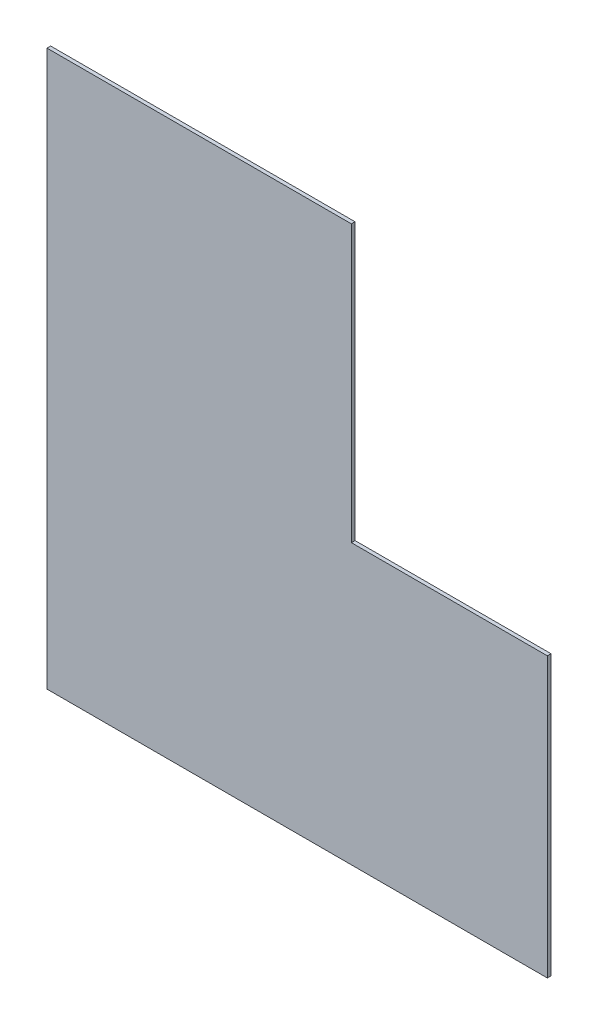
ISO-10303-21;
HEADER;
FILE_DESCRIPTION(('STEP AP214'),'2;1');
FILE_NAME('part.step','',(''),(''),'','','');
FILE_SCHEMA(('AUTOMOTIVE_DESIGN { 1 0 10303 214 1 1 1 1 }'));
ENDSEC;
DATA;
#1=APPLICATION_CONTEXT('core data for automotive mechanical design processes');
#2=APPLICATION_PROTOCOL_DEFINITION('international standard','automotive_design',2000,#1);
#3=PRODUCT_CONTEXT('',#1,'mechanical');
#4=PRODUCT('Part','Part','',(#3));
#5=PRODUCT_RELATED_PRODUCT_CATEGORY('part','',(#4));
#6=PRODUCT_DEFINITION_FORMATION('','',#4);
#7=PRODUCT_DEFINITION_CONTEXT('part definition',#1,'design');
#8=PRODUCT_DEFINITION('design','',#6,#7);
#9=PRODUCT_DEFINITION_SHAPE('','',#8);
#10=(LENGTH_UNIT() NAMED_UNIT(*) SI_UNIT(.MILLI.,.METRE.));
#11=(NAMED_UNIT(*) PLANE_ANGLE_UNIT() SI_UNIT($,.RADIAN.));
#12=(NAMED_UNIT(*) SI_UNIT($,.STERADIAN.) SOLID_ANGLE_UNIT());
#13=UNCERTAINTY_MEASURE_WITH_UNIT(LENGTH_MEASURE(1.E-05),#10,'distance_accuracy_value','');
#14=(GEOMETRIC_REPRESENTATION_CONTEXT(3) GLOBAL_UNCERTAINTY_ASSIGNED_CONTEXT((#13)) GLOBAL_UNIT_ASSIGNED_CONTEXT((#10,
#11,#12)) REPRESENTATION_CONTEXT('',''));
#15=CARTESIAN_POINT('',(0.,0.,0.));
#16=DIRECTION('',(0.,0.,1.));
#17=DIRECTION('',(1.,0.,0.));
#18=AXIS2_PLACEMENT_3D('',#15,#16,#17);
#19=CARTESIAN_POINT('',(2518.,6342.,-15.));
#20=DIRECTION('',(1.,0.,0.));
#21=DIRECTION('',(0.,1.,0.));
#22=AXIS2_PLACEMENT_3D('',#19,#20,#21);
#23=PLANE('',#22);
#24=DIRECTION('',(0.,0.,1.));
#25=VECTOR('',#24,1.);
#26=CARTESIAN_POINT('',(2518.,3191.,-15.));
#27=LINE('',#26,#25);
#28=CARTESIAN_POINT('',(2518.,3191.,-15.));
#29=VERTEX_POINT('',#28);
#30=CARTESIAN_POINT('',(2518.,3191.,0.));
#31=VERTEX_POINT('',#30);
#32=EDGE_CURVE('E114',#29,#31,#27,.T.);
#33=ORIENTED_EDGE('',*,*,#32,.T.);
#34=DIRECTION('',(0.,1.,0.));
#35=VECTOR('',#34,1.);
#36=CARTESIAN_POINT('',(2518.,6342.,0.));
#37=LINE('',#36,#35);
#38=CARTESIAN_POINT('',(2518.,2045.,0.));
#39=VERTEX_POINT('',#38);
#40=EDGE_CURVE('E139',#39,#31,#37,.T.);
#41=ORIENTED_EDGE('',*,*,#40,.F.);
#42=DIRECTION('',(0.,0.,1.));
#43=VECTOR('',#42,1.);
#44=CARTESIAN_POINT('',(2518.,2045.,-15.));
#45=LINE('',#44,#43);
#46=CARTESIAN_POINT('',(2518.,2045.,-15.));
#47=VERTEX_POINT('',#46);
#48=EDGE_CURVE('E132',#47,#39,#45,.T.);
#49=ORIENTED_EDGE('',*,*,#48,.F.);
#50=DIRECTION('',(0.,1.,0.));
#51=VECTOR('',#50,1.);
#52=CARTESIAN_POINT('',(2518.,6342.,-15.));
#53=LINE('',#52,#51);
#54=EDGE_CURVE('E140',#47,#29,#53,.T.);
#55=ORIENTED_EDGE('',*,*,#54,.T.);
#56=EDGE_LOOP('',(#33,#41,#49,#55));
#57=FACE_BOUND('',#56,.T.);
#58=ADVANCED_FACE('F40',(#57),#23,.T.);
#59=CARTESIAN_POINT('',(0.,0.,-15.));
#60=DIRECTION('',(0.,0.,-1.));
#61=DIRECTION('',(-1.,0.,0.));
#62=AXIS2_PLACEMENT_3D('',#59,#60,#61);
#63=PLANE('',#62);
#64=DIRECTION('',(1.,0.,0.));
#65=VECTOR('',#64,1.);
#66=CARTESIAN_POINT('',(2518.,3191.,-15.));
#67=LINE('',#66,#65);
#68=CARTESIAN_POINT('',(1713.,3191.,-15.));
#69=VERTEX_POINT('',#68);
#70=EDGE_CURVE('E99',#69,#29,#67,.T.);
#71=ORIENTED_EDGE('',*,*,#70,.T.);
#72=ORIENTED_EDGE('',*,*,#54,.F.);
#73=DIRECTION('',(-1.,0.,0.));
#74=VECTOR('',#73,1.);
#75=CARTESIAN_POINT('',(0.,2045.,-15.));
#76=LINE('',#75,#74);
#77=CARTESIAN_POINT('',(463.000000000001,2045.,-15.));
#78=VERTEX_POINT('',#77);
#79=EDGE_CURVE('E129',#47,#78,#76,.T.);
#80=ORIENTED_EDGE('',*,*,#79,.T.);
#81=DIRECTION('',(0.,1.,0.));
#82=VECTOR('',#81,1.);
#83=CARTESIAN_POINT('',(463.000000000001,4325.,-15.));
#84=LINE('',#83,#82);
#85=CARTESIAN_POINT('',(463.000000000001,4325.,-15.));
#86=VERTEX_POINT('',#85);
#87=EDGE_CURVE('E54',#78,#86,#84,.T.);
#88=ORIENTED_EDGE('',*,*,#87,.T.);
#89=DIRECTION('',(1.,0.,0.));
#90=VECTOR('',#89,1.);
#91=CARTESIAN_POINT('',(0.,4325.,-15.));
#92=LINE('',#91,#90);
#93=CARTESIAN_POINT('',(1713.,4325.,-15.));
#94=VERTEX_POINT('',#93);
#95=EDGE_CURVE('E102',#86,#94,#92,.T.);
#96=ORIENTED_EDGE('',*,*,#95,.T.);
#97=DIRECTION('',(0.,-1.,0.));
#98=VECTOR('',#97,1.);
#99=CARTESIAN_POINT('',(1713.,2.83852543460134E-13,-15.));
#100=LINE('',#99,#98);
#101=EDGE_CURVE('E94',#94,#69,#100,.T.);
#102=ORIENTED_EDGE('',*,*,#101,.T.);
#103=EDGE_LOOP('',(#71,#72,#80,#88,#96,#102));
#104=FACE_BOUND('',#103,.T.);
#105=ADVANCED_FACE('F96',(#104),#63,.T.);
#106=CARTESIAN_POINT('',(0.,0.,0.));
#107=DIRECTION('',(0.,0.,-1.));
#108=DIRECTION('',(-1.,0.,0.));
#109=AXIS2_PLACEMENT_3D('',#106,#107,#108);
#110=PLANE('',#109);
#111=ORIENTED_EDGE('',*,*,#40,.T.);
#112=DIRECTION('',(-1.,0.,0.));
#113=VECTOR('',#112,1.);
#114=CARTESIAN_POINT('',(0.,3191.,0.));
#115=LINE('',#114,#113);
#116=CARTESIAN_POINT('',(1713.,3191.,0.));
#117=VERTEX_POINT('',#116);
#118=EDGE_CURVE('E11',#31,#117,#115,.T.);
#119=ORIENTED_EDGE('',*,*,#118,.T.);
#120=DIRECTION('',(0.,1.,0.));
#121=VECTOR('',#120,1.);
#122=CARTESIAN_POINT('',(1713.,2.83852543460134E-13,0.));
#123=LINE('',#122,#121);
#124=CARTESIAN_POINT('',(1713.,4325.,0.));
#125=VERTEX_POINT('',#124);
#126=EDGE_CURVE('E47',#117,#125,#123,.T.);
#127=ORIENTED_EDGE('',*,*,#126,.T.);
#128=DIRECTION('',(-1.,0.,0.));
#129=VECTOR('',#128,1.);
#130=CARTESIAN_POINT('',(0.,4325.,0.));
#131=LINE('',#130,#129);
#132=CARTESIAN_POINT('',(463.000000000001,4325.,0.));
#133=VERTEX_POINT('',#132);
#134=EDGE_CURVE('E136',#125,#133,#131,.T.);
#135=ORIENTED_EDGE('',*,*,#134,.T.);
#136=DIRECTION('',(0.,-1.,0.));
#137=VECTOR('',#136,1.);
#138=CARTESIAN_POINT('',(463.000000000001,0.,0.));
#139=LINE('',#138,#137);
#140=CARTESIAN_POINT('',(463.000000000001,2045.,0.));
#141=VERTEX_POINT('',#140);
#142=EDGE_CURVE('E107',#133,#141,#139,.T.);
#143=ORIENTED_EDGE('',*,*,#142,.T.);
#144=DIRECTION('',(1.,0.,0.));
#145=VECTOR('',#144,1.);
#146=CARTESIAN_POINT('',(0.,2045.,0.));
#147=LINE('',#146,#145);
#148=EDGE_CURVE('E62',#141,#39,#147,.T.);
#149=ORIENTED_EDGE('',*,*,#148,.T.);
#150=EDGE_LOOP('',(#111,#119,#127,#135,#143,#149));
#151=FACE_BOUND('',#150,.T.);
#152=ADVANCED_FACE('F142',(#151),#110,.F.);
#153=CARTESIAN_POINT('',(0.,4325.,-15.));
#154=DIRECTION('',(0.,-1.,0.));
#155=DIRECTION('',(0.,0.,-1.));
#156=AXIS2_PLACEMENT_3D('',#153,#154,#155);
#157=PLANE('',#156);
#158=ORIENTED_EDGE('',*,*,#95,.F.);
#159=DIRECTION('',(0.,0.,1.));
#160=VECTOR('',#159,1.);
#161=CARTESIAN_POINT('',(463.000000000001,4325.,-15.));
#162=LINE('',#161,#160);
#163=EDGE_CURVE('E123',#86,#133,#162,.T.);
#164=ORIENTED_EDGE('',*,*,#163,.T.);
#165=ORIENTED_EDGE('',*,*,#134,.F.);
#166=DIRECTION('',(0.,0.,1.));
#167=VECTOR('',#166,1.);
#168=CARTESIAN_POINT('',(1713.,4325.,-15.));
#169=LINE('',#168,#167);
#170=EDGE_CURVE('E106',#94,#125,#169,.T.);
#171=ORIENTED_EDGE('',*,*,#170,.F.);
#172=EDGE_LOOP('',(#158,#164,#165,#171));
#173=FACE_BOUND('',#172,.T.);
#174=ADVANCED_FACE('F150',(#173),#157,.F.);
#175=CARTESIAN_POINT('',(0.,2045.,-15.));
#176=DIRECTION('',(0.,1.,0.));
#177=DIRECTION('',(0.,0.,1.));
#178=AXIS2_PLACEMENT_3D('',#175,#176,#177);
#179=PLANE('',#178);
#180=ORIENTED_EDGE('',*,*,#148,.F.);
#181=DIRECTION('',(0.,0.,1.));
#182=VECTOR('',#181,1.);
#183=CARTESIAN_POINT('',(463.000000000001,2045.,-15.));
#184=LINE('',#183,#182);
#185=EDGE_CURVE('E122',#78,#141,#184,.T.);
#186=ORIENTED_EDGE('',*,*,#185,.F.);
#187=ORIENTED_EDGE('',*,*,#79,.F.);
#188=ORIENTED_EDGE('',*,*,#48,.T.);
#189=EDGE_LOOP('',(#180,#186,#187,#188));
#190=FACE_BOUND('',#189,.T.);
#191=ADVANCED_FACE('F147',(#190),#179,.F.);
#192=CARTESIAN_POINT('',(1713.,2.83852543460134E-13,-15.));
#193=DIRECTION('',(-1.,0.,0.));
#194=DIRECTION('',(0.,-1.,0.));
#195=AXIS2_PLACEMENT_3D('',#192,#193,#194);
#196=PLANE('',#195);
#197=ORIENTED_EDGE('',*,*,#126,.F.);
#198=DIRECTION('',(0.,0.,1.));
#199=VECTOR('',#198,1.);
#200=CARTESIAN_POINT('',(1713.,3191.,-15.));
#201=LINE('',#200,#199);
#202=EDGE_CURVE('E110',#69,#117,#201,.T.);
#203=ORIENTED_EDGE('',*,*,#202,.F.);
#204=ORIENTED_EDGE('',*,*,#101,.F.);
#205=ORIENTED_EDGE('',*,*,#170,.T.);
#206=EDGE_LOOP('',(#197,#203,#204,#205));
#207=FACE_BOUND('',#206,.T.);
#208=ADVANCED_FACE('F111',(#207),#196,.F.);
#209=CARTESIAN_POINT('',(463.000000000001,4325.,-15.));
#210=DIRECTION('',(1.,0.,0.));
#211=DIRECTION('',(0.,1.,0.));
#212=AXIS2_PLACEMENT_3D('',#209,#210,#211);
#213=PLANE('',#212);
#214=ORIENTED_EDGE('',*,*,#163,.F.);
#215=ORIENTED_EDGE('',*,*,#87,.F.);
#216=ORIENTED_EDGE('',*,*,#185,.T.);
#217=ORIENTED_EDGE('',*,*,#142,.F.);
#218=EDGE_LOOP('',(#214,#215,#216,#217));
#219=FACE_BOUND('',#218,.T.);
#220=ADVANCED_FACE('F148',(#219),#213,.F.);
#221=CARTESIAN_POINT('',(2518.,3191.,-15.));
#222=DIRECTION('',(0.,-1.,0.));
#223=DIRECTION('',(0.,0.,-1.));
#224=AXIS2_PLACEMENT_3D('',#221,#222,#223);
#225=PLANE('',#224);
#226=ORIENTED_EDGE('',*,*,#32,.F.);
#227=ORIENTED_EDGE('',*,*,#70,.F.);
#228=ORIENTED_EDGE('',*,*,#202,.T.);
#229=ORIENTED_EDGE('',*,*,#118,.F.);
#230=EDGE_LOOP('',(#226,#227,#228,#229));
#231=FACE_BOUND('',#230,.T.);
#232=ADVANCED_FACE('F116',(#231),#225,.F.);
#233=CLOSED_SHELL('',(#58,#105,#152,#174,#191,#208,#220,#232));
#234=MANIFOLD_SOLID_BREP('B2',#233);
#235=ADVANCED_BREP_SHAPE_REPRESENTATION('',(#18,#234),#14);
#236=SHAPE_DEFINITION_REPRESENTATION(#9,#235);
ENDSEC;
END-ISO-10303-21;
